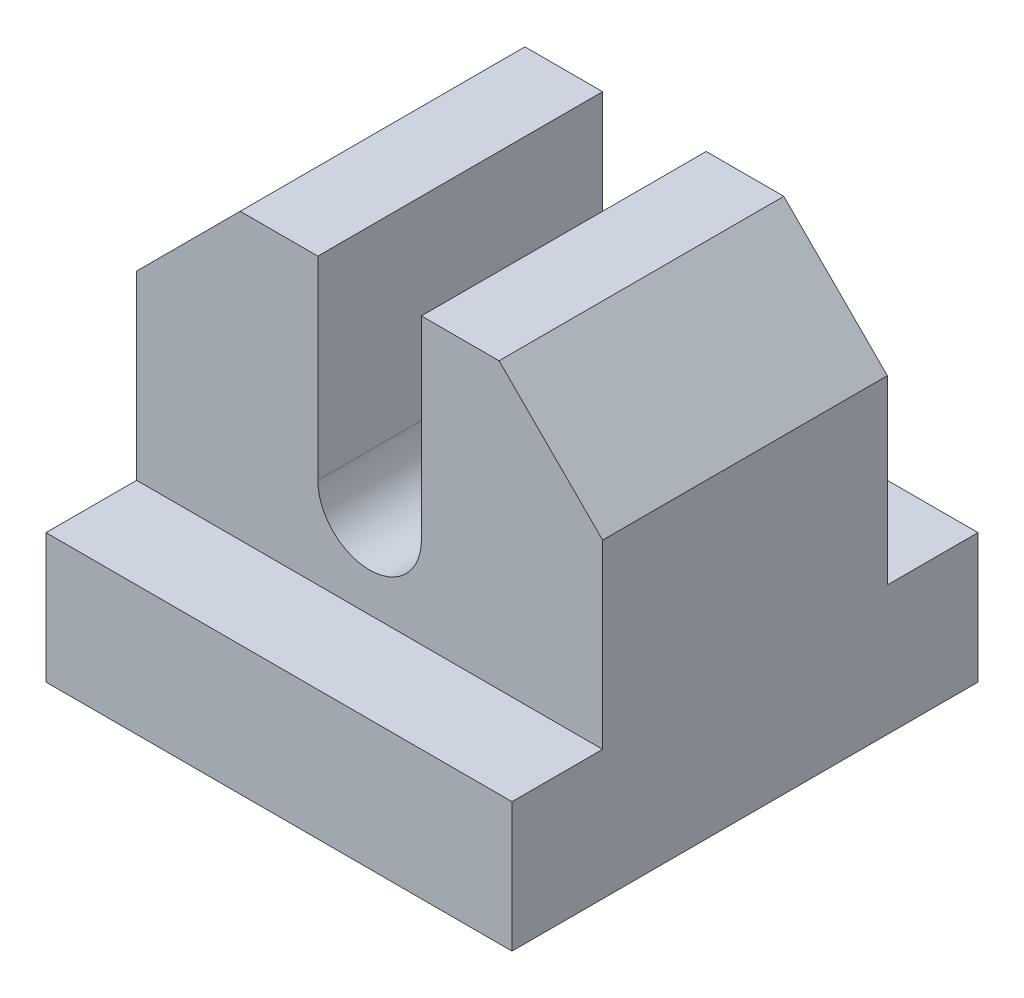
ISO-10303-21;
HEADER;
FILE_DESCRIPTION(('STEP AP214'),'2;1');
FILE_NAME('part.step','',(''),(''),'','','');
FILE_SCHEMA(('AUTOMOTIVE_DESIGN { 1 0 10303 214 1 1 1 1 }'));
ENDSEC;
DATA;
#1=APPLICATION_CONTEXT('core data for automotive mechanical design processes');
#2=APPLICATION_PROTOCOL_DEFINITION('international standard','automotive_design',2000,#1);
#3=PRODUCT_CONTEXT('',#1,'mechanical');
#4=PRODUCT('Part','Part','',(#3));
#5=PRODUCT_RELATED_PRODUCT_CATEGORY('part','',(#4));
#6=PRODUCT_DEFINITION_FORMATION('','',#4);
#7=PRODUCT_DEFINITION_CONTEXT('part definition',#1,'design');
#8=PRODUCT_DEFINITION('design','',#6,#7);
#9=PRODUCT_DEFINITION_SHAPE('','',#8);
#10=(LENGTH_UNIT() NAMED_UNIT(*) SI_UNIT(.MILLI.,.METRE.));
#11=(NAMED_UNIT(*) PLANE_ANGLE_UNIT() SI_UNIT($,.RADIAN.));
#12=(NAMED_UNIT(*) SI_UNIT($,.STERADIAN.) SOLID_ANGLE_UNIT());
#13=UNCERTAINTY_MEASURE_WITH_UNIT(LENGTH_MEASURE(1.E-05),#10,'distance_accuracy_value','');
#14=(GEOMETRIC_REPRESENTATION_CONTEXT(3) GLOBAL_UNCERTAINTY_ASSIGNED_CONTEXT((#13)) GLOBAL_UNIT_ASSIGNED_CONTEXT((#10,
#11,#12)) REPRESENTATION_CONTEXT('',''));
#15=CARTESIAN_POINT('',(0.,0.,0.));
#16=DIRECTION('',(0.,0.,1.));
#17=DIRECTION('',(1.,0.,0.));
#18=AXIS2_PLACEMENT_3D('',#15,#16,#17);
#19=CARTESIAN_POINT('',(-268.200000000001,5.,-380.700000000001));
#20=DIRECTION('',(1.,0.,0.));
#21=DIRECTION('',(0.,0.,-1.));
#22=AXIS2_PLACEMENT_3D('',#19,#20,#21);
#23=PLANE('',#22);
#24=DIRECTION('',(0.,0.,1.));
#25=VECTOR('',#24,1.);
#26=CARTESIAN_POINT('',(-268.200000000001,12.0000000000001,-380.700000000001));
#27=LINE('',#26,#25);
#28=CARTESIAN_POINT('',(-268.200000000001,12.0000000000001,-377.200000000001));
#29=VERTEX_POINT('',#28);
#30=CARTESIAN_POINT('',(-268.200000000001,12.0000000000001,-366.200000000001));
#31=VERTEX_POINT('',#30);
#32=EDGE_CURVE('E190',#29,#31,#27,.T.);
#33=ORIENTED_EDGE('',*,*,#32,.F.);
#34=DIRECTION('',(0.,-1.,0.));
#35=VECTOR('',#34,1.);
#36=CARTESIAN_POINT('',(-268.200000000001,16.,-377.200000000001));
#37=LINE('',#36,#35);
#38=CARTESIAN_POINT('',(-268.200000000001,5.,-377.200000000001));
#39=VERTEX_POINT('',#38);
#40=EDGE_CURVE('E215',#29,#39,#37,.T.);
#41=ORIENTED_EDGE('',*,*,#40,.T.);
#42=DIRECTION('',(0.,0.,1.));
#43=VECTOR('',#42,1.);
#44=CARTESIAN_POINT('',(-268.200000000001,5.,-380.700000000001));
#45=LINE('',#44,#43);
#46=CARTESIAN_POINT('',(-268.200000000001,5.,-380.700000000001));
#47=VERTEX_POINT('',#46);
#48=EDGE_CURVE('E271',#47,#39,#45,.T.);
#49=ORIENTED_EDGE('',*,*,#48,.F.);
#50=DIRECTION('',(0.,-1.,0.));
#51=VECTOR('',#50,1.);
#52=CARTESIAN_POINT('',(-268.200000000001,5.,-380.700000000001));
#53=LINE('',#52,#51);
#54=CARTESIAN_POINT('',(-268.200000000001,0.,-380.700000000001));
#55=VERTEX_POINT('',#54);
#56=EDGE_CURVE('E287',#47,#55,#53,.T.);
#57=ORIENTED_EDGE('',*,*,#56,.T.);
#58=DIRECTION('',(0.,0.,1.));
#59=VECTOR('',#58,1.);
#60=CARTESIAN_POINT('',(-268.200000000001,0.,-380.700000000001));
#61=LINE('',#60,#59);
#62=CARTESIAN_POINT('',(-268.200000000001,0.,-362.700000000001));
#63=VERTEX_POINT('',#62);
#64=EDGE_CURVE('E261',#55,#63,#61,.T.);
#65=ORIENTED_EDGE('',*,*,#64,.T.);
#66=DIRECTION('',(0.,-1.,0.));
#67=VECTOR('',#66,1.);
#68=CARTESIAN_POINT('',(-268.200000000001,5.,-362.700000000001));
#69=LINE('',#68,#67);
#70=CARTESIAN_POINT('',(-268.200000000001,5.,-362.700000000001));
#71=VERTEX_POINT('',#70);
#72=EDGE_CURVE('E311',#71,#63,#69,.T.);
#73=ORIENTED_EDGE('',*,*,#72,.F.);
#74=CARTESIAN_POINT('',(-268.200000000001,5.,-366.200000000001));
#75=VERTEX_POINT('',#74);
#76=EDGE_CURVE('E276',#75,#71,#45,.T.);
#77=ORIENTED_EDGE('',*,*,#76,.F.);
#78=DIRECTION('',(0.,-1.,0.));
#79=VECTOR('',#78,1.);
#80=CARTESIAN_POINT('',(-268.200000000001,16.,-366.200000000001));
#81=LINE('',#80,#79);
#82=EDGE_CURVE('E223',#31,#75,#81,.T.);
#83=ORIENTED_EDGE('',*,*,#82,.F.);
#84=EDGE_LOOP('',(#33,#41,#49,#57,#65,#73,#77,#83));
#85=FACE_BOUND('',#84,.T.);
#86=ADVANCED_FACE('F46',(#85),#23,.F.);
#87=CARTESIAN_POINT('',(-268.200000000001,16.,-366.200000000001));
#88=DIRECTION('',(0.,0.,-1.));
#89=DIRECTION('',(-1.,0.,0.));
#90=AXIS2_PLACEMENT_3D('',#87,#88,#89);
#91=PLANE('',#90);
#92=DIRECTION('',(-0.707106781186551,-0.707106781186544,0.));
#93=VECTOR('',#92,1.);
#94=CARTESIAN_POINT('',(-140.099999999999,140.100000000001,-366.200000000001));
#95=LINE('',#94,#93);
#96=CARTESIAN_POINT('',(-264.200000000001,16.,-366.200000000001));
#97=VERTEX_POINT('',#96);
#98=EDGE_CURVE('E328',#97,#31,#95,.T.);
#99=ORIENTED_EDGE('',*,*,#98,.T.);
#100=ORIENTED_EDGE('',*,*,#82,.T.);
#101=DIRECTION('',(1.,0.,0.));
#102=VECTOR('',#101,1.);
#103=CARTESIAN_POINT('',(-268.200000000001,5.,-366.200000000001));
#104=LINE('',#103,#102);
#105=CARTESIAN_POINT('',(-250.200000000001,5.,-366.200000000001));
#106=VERTEX_POINT('',#105);
#107=EDGE_CURVE('E203',#75,#106,#104,.T.);
#108=ORIENTED_EDGE('',*,*,#107,.T.);
#109=DIRECTION('',(0.,-1.,0.));
#110=VECTOR('',#109,1.);
#111=CARTESIAN_POINT('',(-250.200000000001,16.,-366.200000000001));
#112=LINE('',#111,#110);
#113=CARTESIAN_POINT('',(-250.200000000001,12.,-366.200000000001));
#114=VERTEX_POINT('',#113);
#115=EDGE_CURVE('E187',#114,#106,#112,.T.);
#116=ORIENTED_EDGE('',*,*,#115,.F.);
#117=DIRECTION('',(0.707106781186546,-0.707106781186549,0.));
#118=VECTOR('',#117,1.);
#119=CARTESIAN_POINT('',(-119.100000000001,-119.100000000001,-366.200000000001));
#120=LINE('',#119,#118);
#121=CARTESIAN_POINT('',(-254.200000000001,16.,-366.200000000001));
#122=VERTEX_POINT('',#121);
#123=EDGE_CURVE('E171',#122,#114,#120,.T.);
#124=ORIENTED_EDGE('',*,*,#123,.F.);
#125=DIRECTION('',(1.,0.,0.));
#126=VECTOR('',#125,1.);
#127=CARTESIAN_POINT('',(-268.200000000001,16.,-366.200000000001));
#128=LINE('',#127,#126);
#129=CARTESIAN_POINT('',(-257.200000000001,16.,-366.200000000001));
#130=VERTEX_POINT('',#129);
#131=EDGE_CURVE('E185',#130,#122,#128,.T.);
#132=ORIENTED_EDGE('',*,*,#131,.F.);
#133=DIRECTION('',(0.,-1.,0.));
#134=VECTOR('',#133,1.);
#135=CARTESIAN_POINT('',(-257.200000000001,0.,-366.200000000001));
#136=LINE('',#135,#134);
#137=CARTESIAN_POINT('',(-257.200000000001,8.5,-366.200000000001));
#138=VERTEX_POINT('',#137);
#139=EDGE_CURVE('E69',#130,#138,#136,.T.);
#140=ORIENTED_EDGE('',*,*,#139,.T.);
#141=CARTESIAN_POINT('',(-259.200000000001,8.5,-366.200000000001));
#142=DIRECTION('',(0.,0.,1.));
#143=DIRECTION('',(1.,0.,0.));
#144=AXIS2_PLACEMENT_3D('',#141,#142,#143);
#145=CIRCLE('',#144,2.);
#146=CARTESIAN_POINT('',(-261.200000000001,8.5,-366.200000000001));
#147=VERTEX_POINT('',#146);
#148=EDGE_CURVE('E334',#147,#138,#145,.T.);
#149=ORIENTED_EDGE('',*,*,#148,.F.);
#150=DIRECTION('',(0.,-1.,0.));
#151=VECTOR('',#150,1.);
#152=CARTESIAN_POINT('',(-261.200000000001,0.,-366.200000000001));
#153=LINE('',#152,#151);
#154=CARTESIAN_POINT('',(-261.200000000001,16.,-366.200000000001));
#155=VERTEX_POINT('',#154);
#156=EDGE_CURVE('E332',#155,#147,#153,.T.);
#157=ORIENTED_EDGE('',*,*,#156,.F.);
#158=EDGE_CURVE('E195',#97,#155,#128,.T.);
#159=ORIENTED_EDGE('',*,*,#158,.F.);
#160=EDGE_LOOP('',(#99,#100,#108,#116,#124,#132,#140,#149,#157,#159));
#161=FACE_BOUND('',#160,.T.);
#162=ADVANCED_FACE('F184',(#161),#91,.F.);
#163=CARTESIAN_POINT('',(-268.200000000001,16.,-377.200000000001));
#164=DIRECTION('',(0.,0.,1.));
#165=DIRECTION('',(1.,0.,0.));
#166=AXIS2_PLACEMENT_3D('',#163,#164,#165);
#167=PLANE('',#166);
#168=DIRECTION('',(-0.707106781186551,-0.707106781186544,0.));
#169=VECTOR('',#168,1.);
#170=CARTESIAN_POINT('',(-266.200000000001,14.,-377.200000000001));
#171=LINE('',#170,#169);
#172=CARTESIAN_POINT('',(-264.200000000001,16.,-377.200000000001));
#173=VERTEX_POINT('',#172);
#174=EDGE_CURVE('E207',#173,#29,#171,.T.);
#175=ORIENTED_EDGE('',*,*,#174,.F.);
#176=DIRECTION('',(-1.,0.,0.));
#177=VECTOR('',#176,1.);
#178=CARTESIAN_POINT('',(-268.200000000001,16.,-377.200000000001));
#179=LINE('',#178,#177);
#180=CARTESIAN_POINT('',(-261.200000000001,16.,-377.200000000001));
#181=VERTEX_POINT('',#180);
#182=EDGE_CURVE('E201',#181,#173,#179,.T.);
#183=ORIENTED_EDGE('',*,*,#182,.F.);
#184=DIRECTION('',(0.,-1.,0.));
#185=VECTOR('',#184,1.);
#186=CARTESIAN_POINT('',(-261.200000000001,16.,-377.200000000001));
#187=LINE('',#186,#185);
#188=CARTESIAN_POINT('',(-261.200000000001,8.5,-377.200000000001));
#189=VERTEX_POINT('',#188);
#190=EDGE_CURVE('E357',#181,#189,#187,.T.);
#191=ORIENTED_EDGE('',*,*,#190,.T.);
#192=CARTESIAN_POINT('',(-259.200000000001,8.5,-377.200000000001));
#193=DIRECTION('',(0.,0.,1.));
#194=DIRECTION('',(1.,0.,0.));
#195=AXIS2_PLACEMENT_3D('',#192,#193,#194);
#196=CIRCLE('',#195,2.);
#197=CARTESIAN_POINT('',(-257.200000000001,8.5,-377.200000000001));
#198=VERTEX_POINT('',#197);
#199=EDGE_CURVE('E12',#189,#198,#196,.T.);
#200=ORIENTED_EDGE('',*,*,#199,.T.);
#201=DIRECTION('',(0.,-1.,0.));
#202=VECTOR('',#201,1.);
#203=CARTESIAN_POINT('',(-257.200000000001,16.,-377.200000000001));
#204=LINE('',#203,#202);
#205=CARTESIAN_POINT('',(-257.200000000001,16.,-377.200000000001));
#206=VERTEX_POINT('',#205);
#207=EDGE_CURVE('E352',#206,#198,#204,.T.);
#208=ORIENTED_EDGE('',*,*,#207,.F.);
#209=CARTESIAN_POINT('',(-254.200000000001,16.,-377.200000000001));
#210=VERTEX_POINT('',#209);
#211=EDGE_CURVE('E212',#210,#206,#179,.T.);
#212=ORIENTED_EDGE('',*,*,#211,.F.);
#213=DIRECTION('',(0.707106781186546,-0.707106781186549,0.));
#214=VECTOR('',#213,1.);
#215=CARTESIAN_POINT('',(-261.200000000001,23.,-377.200000000001));
#216=LINE('',#215,#214);
#217=CARTESIAN_POINT('',(-250.200000000001,12.,-377.200000000001));
#218=VERTEX_POINT('',#217);
#219=EDGE_CURVE('E61',#210,#218,#216,.T.);
#220=ORIENTED_EDGE('',*,*,#219,.T.);
#221=DIRECTION('',(0.,-1.,0.));
#222=VECTOR('',#221,1.);
#223=CARTESIAN_POINT('',(-250.200000000001,16.,-377.200000000001));
#224=LINE('',#223,#222);
#225=CARTESIAN_POINT('',(-250.200000000001,5.,-377.200000000001));
#226=VERTEX_POINT('',#225);
#227=EDGE_CURVE('E218',#218,#226,#224,.T.);
#228=ORIENTED_EDGE('',*,*,#227,.T.);
#229=DIRECTION('',(-1.,0.,0.));
#230=VECTOR('',#229,1.);
#231=CARTESIAN_POINT('',(-268.200000000001,5.,-377.200000000001));
#232=LINE('',#231,#230);
#233=EDGE_CURVE('E196',#226,#39,#232,.T.);
#234=ORIENTED_EDGE('',*,*,#233,.T.);
#235=ORIENTED_EDGE('',*,*,#40,.F.);
#236=EDGE_LOOP('',(#175,#183,#191,#200,#208,#212,#220,#228,#234,#235));
#237=FACE_BOUND('',#236,.T.);
#238=ADVANCED_FACE('F371',(#237),#167,.F.);
#239=CARTESIAN_POINT('',(0.,16.,0.));
#240=DIRECTION('',(0.,1.,0.));
#241=DIRECTION('',(0.,0.,1.));
#242=AXIS2_PLACEMENT_3D('',#239,#240,#241);
#243=PLANE('',#242);
#244=ORIENTED_EDGE('',*,*,#182,.T.);
#245=DIRECTION('',(0.,0.,1.));
#246=VECTOR('',#245,1.);
#247=CARTESIAN_POINT('',(-264.200000000001,16.,0.));
#248=LINE('',#247,#246);
#249=EDGE_CURVE('E54',#173,#97,#248,.T.);
#250=ORIENTED_EDGE('',*,*,#249,.T.);
#251=ORIENTED_EDGE('',*,*,#158,.T.);
#252=DIRECTION('',(0.,0.,1.));
#253=VECTOR('',#252,1.);
#254=CARTESIAN_POINT('',(-261.200000000001,16.,0.));
#255=LINE('',#254,#253);
#256=EDGE_CURVE('E178',#181,#155,#255,.T.);
#257=ORIENTED_EDGE('',*,*,#256,.F.);
#258=EDGE_LOOP('',(#244,#250,#251,#257));
#259=FACE_BOUND('',#258,.T.);
#260=ADVANCED_FACE('F322',(#259),#243,.T.);
#261=DIRECTION('',(0.,0.,1.));
#262=VECTOR('',#261,1.);
#263=CARTESIAN_POINT('',(-254.200000000001,16.,0.));
#264=LINE('',#263,#262);
#265=EDGE_CURVE('E168',#210,#122,#264,.T.);
#266=ORIENTED_EDGE('',*,*,#265,.F.);
#267=ORIENTED_EDGE('',*,*,#211,.T.);
#268=DIRECTION('',(0.,0.,1.));
#269=VECTOR('',#268,1.);
#270=CARTESIAN_POINT('',(-257.200000000001,16.,0.));
#271=LINE('',#270,#269);
#272=EDGE_CURVE('E193',#206,#130,#271,.T.);
#273=ORIENTED_EDGE('',*,*,#272,.T.);
#274=ORIENTED_EDGE('',*,*,#131,.T.);
#275=EDGE_LOOP('',(#266,#267,#273,#274));
#276=FACE_BOUND('',#275,.T.);
#277=ADVANCED_FACE('F192',(#276),#243,.T.);
#278=CARTESIAN_POINT('',(0.,5.,0.));
#279=DIRECTION('',(0.,1.,0.));
#280=DIRECTION('',(0.,0.,1.));
#281=AXIS2_PLACEMENT_3D('',#278,#279,#280);
#282=PLANE('',#281);
#283=ORIENTED_EDGE('',*,*,#233,.F.);
#284=DIRECTION('',(0.,0.,-1.));
#285=VECTOR('',#284,1.);
#286=CARTESIAN_POINT('',(-250.200000000001,5.,-380.700000000001));
#287=LINE('',#286,#285);
#288=CARTESIAN_POINT('',(-250.200000000001,5.,-380.700000000001));
#289=VERTEX_POINT('',#288);
#290=EDGE_CURVE('E279',#226,#289,#287,.T.);
#291=ORIENTED_EDGE('',*,*,#290,.T.);
#292=DIRECTION('',(-1.,0.,0.));
#293=VECTOR('',#292,1.);
#294=CARTESIAN_POINT('',(-268.200000000001,5.,-380.700000000001));
#295=LINE('',#294,#293);
#296=EDGE_CURVE('E284',#289,#47,#295,.T.);
#297=ORIENTED_EDGE('',*,*,#296,.T.);
#298=ORIENTED_EDGE('',*,*,#48,.T.);
#299=EDGE_LOOP('',(#283,#291,#297,#298));
#300=FACE_BOUND('',#299,.T.);
#301=ADVANCED_FACE('F375',(#300),#282,.T.);
#302=CARTESIAN_POINT('',(-268.200000000001,5.,-362.700000000001));
#303=DIRECTION('',(0.,0.,-1.));
#304=DIRECTION('',(-1.,0.,0.));
#305=AXIS2_PLACEMENT_3D('',#302,#303,#304);
#306=PLANE('',#305);
#307=DIRECTION('',(1.,0.,0.));
#308=VECTOR('',#307,1.);
#309=CARTESIAN_POINT('',(-268.200000000001,0.,-362.700000000001));
#310=LINE('',#309,#308);
#311=CARTESIAN_POINT('',(-250.200000000001,0.,-362.700000000001));
#312=VERTEX_POINT('',#311);
#313=EDGE_CURVE('E291',#63,#312,#310,.T.);
#314=ORIENTED_EDGE('',*,*,#313,.T.);
#315=DIRECTION('',(0.,-1.,0.));
#316=VECTOR('',#315,1.);
#317=CARTESIAN_POINT('',(-250.200000000001,5.,-362.700000000001));
#318=LINE('',#317,#316);
#319=CARTESIAN_POINT('',(-250.200000000001,5.,-362.700000000001));
#320=VERTEX_POINT('',#319);
#321=EDGE_CURVE('E307',#320,#312,#318,.T.);
#322=ORIENTED_EDGE('',*,*,#321,.F.);
#323=DIRECTION('',(1.,0.,0.));
#324=VECTOR('',#323,1.);
#325=CARTESIAN_POINT('',(-268.200000000001,5.,-362.700000000001));
#326=LINE('',#325,#324);
#327=EDGE_CURVE('E275',#71,#320,#326,.T.);
#328=ORIENTED_EDGE('',*,*,#327,.F.);
#329=ORIENTED_EDGE('',*,*,#72,.T.);
#330=EDGE_LOOP('',(#314,#322,#328,#329));
#331=FACE_BOUND('',#330,.T.);
#332=ADVANCED_FACE('F441',(#331),#306,.F.);
#333=CARTESIAN_POINT('',(-250.200000000001,5.,-380.700000000001));
#334=DIRECTION('',(-1.,0.,0.));
#335=DIRECTION('',(0.,0.,1.));
#336=AXIS2_PLACEMENT_3D('',#333,#334,#335);
#337=PLANE('',#336);
#338=ORIENTED_EDGE('',*,*,#227,.F.);
#339=DIRECTION('',(0.,0.,1.));
#340=VECTOR('',#339,1.);
#341=CARTESIAN_POINT('',(-250.200000000001,12.,-380.700000000001));
#342=LINE('',#341,#340);
#343=EDGE_CURVE('E189',#218,#114,#342,.T.);
#344=ORIENTED_EDGE('',*,*,#343,.T.);
#345=ORIENTED_EDGE('',*,*,#115,.T.);
#346=EDGE_CURVE('E280',#320,#106,#287,.T.);
#347=ORIENTED_EDGE('',*,*,#346,.F.);
#348=ORIENTED_EDGE('',*,*,#321,.T.);
#349=DIRECTION('',(0.,0.,-1.));
#350=VECTOR('',#349,1.);
#351=CARTESIAN_POINT('',(-250.200000000001,0.,-380.700000000001));
#352=LINE('',#351,#350);
#353=CARTESIAN_POINT('',(-250.200000000001,0.,-380.700000000001));
#354=VERTEX_POINT('',#353);
#355=EDGE_CURVE('E294',#312,#354,#352,.T.);
#356=ORIENTED_EDGE('',*,*,#355,.T.);
#357=DIRECTION('',(0.,-1.,0.));
#358=VECTOR('',#357,1.);
#359=CARTESIAN_POINT('',(-250.200000000001,5.,-380.700000000001));
#360=LINE('',#359,#358);
#361=EDGE_CURVE('E303',#289,#354,#360,.T.);
#362=ORIENTED_EDGE('',*,*,#361,.F.);
#363=ORIENTED_EDGE('',*,*,#290,.F.);
#364=EDGE_LOOP('',(#338,#344,#345,#347,#348,#356,#362,#363));
#365=FACE_BOUND('',#364,.T.);
#366=ADVANCED_FACE('F378',(#365),#337,.F.);
#367=CARTESIAN_POINT('',(-268.200000000001,5.,-380.700000000001));
#368=DIRECTION('',(0.,0.,1.));
#369=DIRECTION('',(1.,0.,0.));
#370=AXIS2_PLACEMENT_3D('',#367,#368,#369);
#371=PLANE('',#370);
#372=DIRECTION('',(-1.,0.,0.));
#373=VECTOR('',#372,1.);
#374=CARTESIAN_POINT('',(-268.200000000001,0.,-380.700000000001));
#375=LINE('',#374,#373);
#376=EDGE_CURVE('E297',#354,#55,#375,.T.);
#377=ORIENTED_EDGE('',*,*,#376,.T.);
#378=ORIENTED_EDGE('',*,*,#56,.F.);
#379=ORIENTED_EDGE('',*,*,#296,.F.);
#380=ORIENTED_EDGE('',*,*,#361,.T.);
#381=EDGE_LOOP('',(#377,#378,#379,#380));
#382=FACE_BOUND('',#381,.T.);
#383=ADVANCED_FACE('F432',(#382),#371,.F.);
#384=ORIENTED_EDGE('',*,*,#107,.F.);
#385=ORIENTED_EDGE('',*,*,#76,.T.);
#386=ORIENTED_EDGE('',*,*,#327,.T.);
#387=ORIENTED_EDGE('',*,*,#346,.T.);
#388=EDGE_LOOP('',(#384,#385,#386,#387));
#389=FACE_BOUND('',#388,.T.);
#390=ADVANCED_FACE('F430',(#389),#282,.T.);
#391=CARTESIAN_POINT('',(0.,0.,0.));
#392=DIRECTION('',(0.,1.,0.));
#393=DIRECTION('',(0.,0.,1.));
#394=AXIS2_PLACEMENT_3D('',#391,#392,#393);
#395=PLANE('',#394);
#396=DIRECTION('',(-1.,0.,0.));
#397=VECTOR('',#396,1.);
#398=CARTESIAN_POINT('',(-253.200000000001,0.,-365.700000000001));
#399=LINE('',#398,#397);
#400=CARTESIAN_POINT('',(-253.200000000001,0.,-365.700000000001));
#401=VERTEX_POINT('',#400);
#402=CARTESIAN_POINT('',(-265.200000000001,0.,-365.700000000001));
#403=VERTEX_POINT('',#402);
#404=EDGE_CURVE('E247',#401,#403,#399,.T.);
#405=ORIENTED_EDGE('',*,*,#404,.F.);
#406=DIRECTION('',(0.,0.,1.));
#407=VECTOR('',#406,1.);
#408=CARTESIAN_POINT('',(-253.200000000001,0.,-377.700000000001));
#409=LINE('',#408,#407);
#410=CARTESIAN_POINT('',(-253.200000000001,0.,-377.700000000001));
#411=VERTEX_POINT('',#410);
#412=EDGE_CURVE('E226',#411,#401,#409,.T.);
#413=ORIENTED_EDGE('',*,*,#412,.F.);
#414=DIRECTION('',(1.,0.,0.));
#415=VECTOR('',#414,1.);
#416=CARTESIAN_POINT('',(-253.200000000001,0.,-377.700000000001));
#417=LINE('',#416,#415);
#418=CARTESIAN_POINT('',(-265.200000000001,0.,-377.700000000001));
#419=VERTEX_POINT('',#418);
#420=EDGE_CURVE('E232',#419,#411,#417,.T.);
#421=ORIENTED_EDGE('',*,*,#420,.F.);
#422=DIRECTION('',(0.,0.,-1.));
#423=VECTOR('',#422,1.);
#424=CARTESIAN_POINT('',(-265.200000000001,0.,-377.700000000001));
#425=LINE('',#424,#423);
#426=EDGE_CURVE('E251',#403,#419,#425,.T.);
#427=ORIENTED_EDGE('',*,*,#426,.F.);
#428=EDGE_LOOP('',(#405,#413,#421,#427));
#429=FACE_BOUND('',#428,.T.);
#430=ORIENTED_EDGE('',*,*,#64,.F.);
#431=ORIENTED_EDGE('',*,*,#376,.F.);
#432=ORIENTED_EDGE('',*,*,#355,.F.);
#433=ORIENTED_EDGE('',*,*,#313,.F.);
#434=EDGE_LOOP('',(#430,#431,#432,#433));
#435=FACE_BOUND('',#434,.T.);
#436=ADVANCED_FACE('F428',(#429,#435),#395,.F.);
#437=CARTESIAN_POINT('',(-253.200000000001,3.,-377.700000000001));
#438=DIRECTION('',(1.,0.,0.));
#439=DIRECTION('',(0.,0.,-1.));
#440=AXIS2_PLACEMENT_3D('',#437,#438,#439);
#441=PLANE('',#440);
#442=ORIENTED_EDGE('',*,*,#412,.T.);
#443=DIRECTION('',(0.,-1.,0.));
#444=VECTOR('',#443,1.);
#445=CARTESIAN_POINT('',(-253.200000000001,3.,-365.700000000001));
#446=LINE('',#445,#444);
#447=CARTESIAN_POINT('',(-253.200000000001,3.,-365.700000000001));
#448=VERTEX_POINT('',#447);
#449=EDGE_CURVE('E244',#448,#401,#446,.T.);
#450=ORIENTED_EDGE('',*,*,#449,.F.);
#451=DIRECTION('',(0.,0.,1.));
#452=VECTOR('',#451,1.);
#453=CARTESIAN_POINT('',(-253.200000000001,3.,-377.700000000001));
#454=LINE('',#453,#452);
#455=CARTESIAN_POINT('',(-253.200000000001,3.,-377.700000000001));
#456=VERTEX_POINT('',#455);
#457=EDGE_CURVE('E227',#456,#448,#454,.T.);
#458=ORIENTED_EDGE('',*,*,#457,.F.);
#459=DIRECTION('',(0.,-1.,0.));
#460=VECTOR('',#459,1.);
#461=CARTESIAN_POINT('',(-253.200000000001,3.,-377.700000000001));
#462=LINE('',#461,#460);
#463=EDGE_CURVE('E258',#456,#411,#462,.T.);
#464=ORIENTED_EDGE('',*,*,#463,.T.);
#465=EDGE_LOOP('',(#442,#450,#458,#464));
#466=FACE_BOUND('',#465,.T.);
#467=ADVANCED_FACE('F418',(#466),#441,.F.);
#468=CARTESIAN_POINT('',(-253.200000000001,3.,-377.700000000001));
#469=DIRECTION('',(0.,0.,-1.));
#470=DIRECTION('',(-1.,0.,0.));
#471=AXIS2_PLACEMENT_3D('',#468,#469,#470);
#472=PLANE('',#471);
#473=ORIENTED_EDGE('',*,*,#420,.T.);
#474=ORIENTED_EDGE('',*,*,#463,.F.);
#475=DIRECTION('',(1.,0.,0.));
#476=VECTOR('',#475,1.);
#477=CARTESIAN_POINT('',(-253.200000000001,3.,-377.700000000001));
#478=LINE('',#477,#476);
#479=CARTESIAN_POINT('',(-265.200000000001,3.,-377.700000000001));
#480=VERTEX_POINT('',#479);
#481=EDGE_CURVE('E240',#480,#456,#478,.T.);
#482=ORIENTED_EDGE('',*,*,#481,.F.);
#483=DIRECTION('',(0.,-1.,0.));
#484=VECTOR('',#483,1.);
#485=CARTESIAN_POINT('',(-265.200000000001,3.,-377.700000000001));
#486=LINE('',#485,#484);
#487=EDGE_CURVE('E262',#480,#419,#486,.T.);
#488=ORIENTED_EDGE('',*,*,#487,.T.);
#489=EDGE_LOOP('',(#473,#474,#482,#488));
#490=FACE_BOUND('',#489,.T.);
#491=ADVANCED_FACE('F414',(#490),#472,.F.);
#492=CARTESIAN_POINT('',(-265.200000000001,3.,-377.700000000001));
#493=DIRECTION('',(-1.,0.,0.));
#494=DIRECTION('',(0.,0.,1.));
#495=AXIS2_PLACEMENT_3D('',#492,#493,#494);
#496=PLANE('',#495);
#497=ORIENTED_EDGE('',*,*,#426,.T.);
#498=ORIENTED_EDGE('',*,*,#487,.F.);
#499=DIRECTION('',(0.,0.,-1.));
#500=VECTOR('',#499,1.);
#501=CARTESIAN_POINT('',(-265.200000000001,3.,-377.700000000001));
#502=LINE('',#501,#500);
#503=CARTESIAN_POINT('',(-265.200000000001,3.,-365.700000000001));
#504=VERTEX_POINT('',#503);
#505=EDGE_CURVE('E236',#504,#480,#502,.T.);
#506=ORIENTED_EDGE('',*,*,#505,.F.);
#507=DIRECTION('',(0.,-1.,0.));
#508=VECTOR('',#507,1.);
#509=CARTESIAN_POINT('',(-265.200000000001,3.,-365.700000000001));
#510=LINE('',#509,#508);
#511=EDGE_CURVE('E265',#504,#403,#510,.T.);
#512=ORIENTED_EDGE('',*,*,#511,.T.);
#513=EDGE_LOOP('',(#497,#498,#506,#512));
#514=FACE_BOUND('',#513,.T.);
#515=ADVANCED_FACE('F417',(#514),#496,.F.);
#516=CARTESIAN_POINT('',(-253.200000000001,3.,-365.700000000001));
#517=DIRECTION('',(0.,0.,1.));
#518=DIRECTION('',(1.,0.,0.));
#519=AXIS2_PLACEMENT_3D('',#516,#517,#518);
#520=PLANE('',#519);
#521=ORIENTED_EDGE('',*,*,#404,.T.);
#522=ORIENTED_EDGE('',*,*,#511,.F.);
#523=DIRECTION('',(-1.,0.,0.));
#524=VECTOR('',#523,1.);
#525=CARTESIAN_POINT('',(-253.200000000001,3.,-365.700000000001));
#526=LINE('',#525,#524);
#527=EDGE_CURVE('E231',#448,#504,#526,.T.);
#528=ORIENTED_EDGE('',*,*,#527,.F.);
#529=ORIENTED_EDGE('',*,*,#449,.T.);
#530=EDGE_LOOP('',(#521,#522,#528,#529));
#531=FACE_BOUND('',#530,.T.);
#532=ADVANCED_FACE('F412',(#531),#520,.F.);
#533=CARTESIAN_POINT('',(0.,3.,0.));
#534=DIRECTION('',(0.,-1.,0.));
#535=DIRECTION('',(0.,0.,-1.));
#536=AXIS2_PLACEMENT_3D('',#533,#534,#535);
#537=PLANE('',#536);
#538=ORIENTED_EDGE('',*,*,#457,.T.);
#539=ORIENTED_EDGE('',*,*,#527,.T.);
#540=ORIENTED_EDGE('',*,*,#505,.T.);
#541=ORIENTED_EDGE('',*,*,#481,.T.);
#542=EDGE_LOOP('',(#538,#539,#540,#541));
#543=FACE_BOUND('',#542,.T.);
#544=ADVANCED_FACE('F396',(#543),#537,.T.);
#545=CARTESIAN_POINT('',(-259.200000000001,8.5,-380.700000000001));
#546=DIRECTION('',(0.,0.,1.));
#547=DIRECTION('',(1.,0.,0.));
#548=AXIS2_PLACEMENT_3D('',#545,#546,#547);
#549=CYLINDRICAL_SURFACE('',#548,2.);
#550=DIRECTION('',(0.,0.,1.));
#551=VECTOR('',#550,1.);
#552=CARTESIAN_POINT('',(-261.200000000001,8.5,-380.700000000001));
#553=LINE('',#552,#551);
#554=EDGE_CURVE('E348',#189,#147,#553,.T.);
#555=ORIENTED_EDGE('',*,*,#554,.T.);
#556=ORIENTED_EDGE('',*,*,#148,.T.);
#557=DIRECTION('',(0.,0.,1.));
#558=VECTOR('',#557,1.);
#559=CARTESIAN_POINT('',(-257.200000000001,8.5,-380.700000000001));
#560=LINE('',#559,#558);
#561=EDGE_CURVE('E349',#198,#138,#560,.T.);
#562=ORIENTED_EDGE('',*,*,#561,.F.);
#563=ORIENTED_EDGE('',*,*,#199,.F.);
#564=EDGE_LOOP('',(#555,#556,#562,#563));
#565=FACE_BOUND('',#564,.T.);
#566=ADVANCED_FACE('F387',(#565),#549,.F.);
#567=CARTESIAN_POINT('',(-261.200000000001,0.,-380.700000000001));
#568=DIRECTION('',(-1.,0.,0.));
#569=DIRECTION('',(0.,0.,1.));
#570=AXIS2_PLACEMENT_3D('',#567,#568,#569);
#571=PLANE('',#570);
#572=ORIENTED_EDGE('',*,*,#256,.T.);
#573=ORIENTED_EDGE('',*,*,#156,.T.);
#574=ORIENTED_EDGE('',*,*,#554,.F.);
#575=ORIENTED_EDGE('',*,*,#190,.F.);
#576=EDGE_LOOP('',(#572,#573,#574,#575));
#577=FACE_BOUND('',#576,.T.);
#578=ADVANCED_FACE('F388',(#577),#571,.F.);
#579=CARTESIAN_POINT('',(-257.200000000001,0.,-380.700000000001));
#580=DIRECTION('',(-1.,0.,0.));
#581=DIRECTION('',(0.,0.,1.));
#582=AXIS2_PLACEMENT_3D('',#579,#580,#581);
#583=PLANE('',#582);
#584=ORIENTED_EDGE('',*,*,#207,.T.);
#585=ORIENTED_EDGE('',*,*,#561,.T.);
#586=ORIENTED_EDGE('',*,*,#139,.F.);
#587=ORIENTED_EDGE('',*,*,#272,.F.);
#588=EDGE_LOOP('',(#584,#585,#586,#587));
#589=FACE_BOUND('',#588,.T.);
#590=ADVANCED_FACE('F385',(#589),#583,.T.);
#591=CARTESIAN_POINT('',(-119.100000000001,-119.100000000001,-380.700000000001));
#592=DIRECTION('',(-0.707106781186549,-0.707106781186546,0.));
#593=DIRECTION('',(0.707106781186546,-0.707106781186549,0.));
#594=AXIS2_PLACEMENT_3D('',#591,#592,#593);
#595=PLANE('',#594);
#596=ORIENTED_EDGE('',*,*,#265,.T.);
#597=ORIENTED_EDGE('',*,*,#123,.T.);
#598=ORIENTED_EDGE('',*,*,#343,.F.);
#599=ORIENTED_EDGE('',*,*,#219,.F.);
#600=EDGE_LOOP('',(#596,#597,#598,#599));
#601=FACE_BOUND('',#600,.T.);
#602=ADVANCED_FACE('F170',(#601),#595,.F.);
#603=CARTESIAN_POINT('',(-140.099999999999,140.100000000001,-380.700000000001));
#604=DIRECTION('',(-0.707106781186544,0.707106781186551,0.));
#605=DIRECTION('',(-0.707106781186551,-0.707106781186544,0.));
#606=AXIS2_PLACEMENT_3D('',#603,#604,#605);
#607=PLANE('',#606);
#608=ORIENTED_EDGE('',*,*,#174,.T.);
#609=ORIENTED_EDGE('',*,*,#32,.T.);
#610=ORIENTED_EDGE('',*,*,#98,.F.);
#611=ORIENTED_EDGE('',*,*,#249,.F.);
#612=EDGE_LOOP('',(#608,#609,#610,#611));
#613=FACE_BOUND('',#612,.T.);
#614=ADVANCED_FACE('F365',(#613),#607,.T.);
#615=CLOSED_SHELL('',(#86,#162,#238,#260,#277,#301,#332,#366,#383,#390,#436,#467,#491,#515,#532,
#544,#566,#578,#590,#602,#614));
#616=MANIFOLD_SOLID_BREP('B2',#615);
#617=ADVANCED_BREP_SHAPE_REPRESENTATION('',(#18,#616),#14);
#618=SHAPE_DEFINITION_REPRESENTATION(#9,#617);
ENDSEC;
END-ISO-10303-21;
